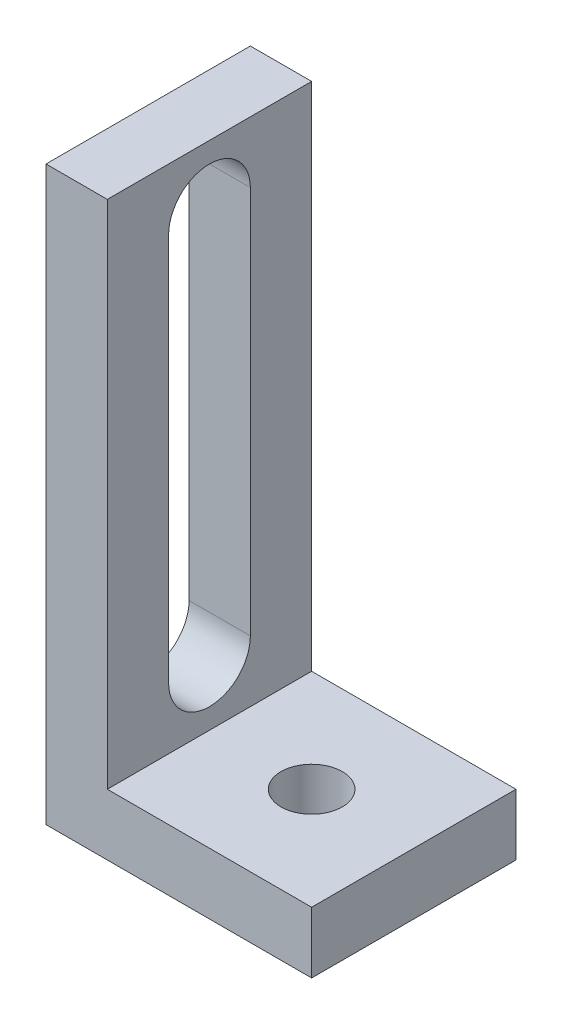
ISO-10303-21;
HEADER;
FILE_DESCRIPTION(('STEP AP214'),'2;1');
FILE_NAME('part.step','',(''),(''),'','','');
FILE_SCHEMA(('AUTOMOTIVE_DESIGN { 1 0 10303 214 1 1 1 1 }'));
ENDSEC;
DATA;
#1=APPLICATION_CONTEXT('core data for automotive mechanical design processes');
#2=APPLICATION_PROTOCOL_DEFINITION('international standard','automotive_design',2000,#1);
#3=PRODUCT_CONTEXT('',#1,'mechanical');
#4=PRODUCT('Part','Part','',(#3));
#5=PRODUCT_RELATED_PRODUCT_CATEGORY('part','',(#4));
#6=PRODUCT_DEFINITION_FORMATION('','',#4);
#7=PRODUCT_DEFINITION_CONTEXT('part definition',#1,'design');
#8=PRODUCT_DEFINITION('design','',#6,#7);
#9=PRODUCT_DEFINITION_SHAPE('','',#8);
#10=(LENGTH_UNIT() NAMED_UNIT(*) SI_UNIT(.MILLI.,.METRE.));
#11=(NAMED_UNIT(*) PLANE_ANGLE_UNIT() SI_UNIT($,.RADIAN.));
#12=(NAMED_UNIT(*) SI_UNIT($,.STERADIAN.) SOLID_ANGLE_UNIT());
#13=UNCERTAINTY_MEASURE_WITH_UNIT(LENGTH_MEASURE(1.E-05),#10,'distance_accuracy_value','');
#14=(GEOMETRIC_REPRESENTATION_CONTEXT(3) GLOBAL_UNCERTAINTY_ASSIGNED_CONTEXT((#13)) GLOBAL_UNIT_ASSIGNED_CONTEXT((#10,
#11,#12)) REPRESENTATION_CONTEXT('',''));
#15=CARTESIAN_POINT('',(0.,0.,0.));
#16=DIRECTION('',(0.,0.,1.));
#17=DIRECTION('',(1.,0.,0.));
#18=AXIS2_PLACEMENT_3D('',#15,#16,#17);
#19=CARTESIAN_POINT('',(10.,3.,10.));
#20=DIRECTION('',(-1.,0.,0.));
#21=DIRECTION('',(0.,0.,1.));
#22=AXIS2_PLACEMENT_3D('',#19,#20,#21);
#23=PLANE('',#22);
#24=DIRECTION('',(0.,0.,-1.));
#25=VECTOR('',#24,1.);
#26=CARTESIAN_POINT('',(10.,0.,10.));
#27=LINE('',#26,#25);
#28=CARTESIAN_POINT('',(10.,0.,10.));
#29=VERTEX_POINT('',#28);
#30=CARTESIAN_POINT('',(10.,0.,0.));
#31=VERTEX_POINT('',#30);
#32=EDGE_CURVE('E166',#29,#31,#27,.T.);
#33=ORIENTED_EDGE('',*,*,#32,.T.);
#34=DIRECTION('',(0.,-1.,0.));
#35=VECTOR('',#34,1.);
#36=CARTESIAN_POINT('',(10.,3.,0.));
#37=LINE('',#36,#35);
#38=CARTESIAN_POINT('',(10.,3.,0.));
#39=VERTEX_POINT('',#38);
#40=EDGE_CURVE('E189',#39,#31,#37,.T.);
#41=ORIENTED_EDGE('',*,*,#40,.F.);
#42=DIRECTION('',(0.,0.,-1.));
#43=VECTOR('',#42,1.);
#44=CARTESIAN_POINT('',(10.,3.,10.));
#45=LINE('',#44,#43);
#46=CARTESIAN_POINT('',(10.,3.,10.));
#47=VERTEX_POINT('',#46);
#48=EDGE_CURVE('E169',#47,#39,#45,.T.);
#49=ORIENTED_EDGE('',*,*,#48,.F.);
#50=DIRECTION('',(0.,-1.,0.));
#51=VECTOR('',#50,1.);
#52=CARTESIAN_POINT('',(10.,3.,10.));
#53=LINE('',#52,#51);
#54=EDGE_CURVE('E181',#47,#29,#53,.T.);
#55=ORIENTED_EDGE('',*,*,#54,.T.);
#56=EDGE_LOOP('',(#33,#41,#49,#55));
#57=FACE_BOUND('',#56,.T.);
#58=ADVANCED_FACE('F35',(#57),#23,.F.);
#59=CARTESIAN_POINT('',(10.,3.,0.));
#60=DIRECTION('',(0.,0.,1.));
#61=DIRECTION('',(1.,0.,0.));
#62=AXIS2_PLACEMENT_3D('',#59,#60,#61);
#63=PLANE('',#62);
#64=DIRECTION('',(-1.,0.,0.));
#65=VECTOR('',#64,1.);
#66=CARTESIAN_POINT('',(10.,0.,0.));
#67=LINE('',#66,#65);
#68=CARTESIAN_POINT('',(-3.,0.,0.));
#69=VERTEX_POINT('',#68);
#70=EDGE_CURVE('E184',#31,#69,#67,.T.);
#71=ORIENTED_EDGE('',*,*,#70,.T.);
#72=DIRECTION('',(0.,-1.,0.));
#73=VECTOR('',#72,1.);
#74=CARTESIAN_POINT('',(-3.,28.,0.));
#75=LINE('',#74,#73);
#76=CARTESIAN_POINT('',(-3.,28.,0.));
#77=VERTEX_POINT('',#76);
#78=EDGE_CURVE('E145',#77,#69,#75,.T.);
#79=ORIENTED_EDGE('',*,*,#78,.F.);
#80=DIRECTION('',(-1.,0.,0.));
#81=VECTOR('',#80,1.);
#82=CARTESIAN_POINT('',(0.,28.,0.));
#83=LINE('',#82,#81);
#84=CARTESIAN_POINT('',(0.,28.,0.));
#85=VERTEX_POINT('',#84);
#86=EDGE_CURVE('E141',#85,#77,#83,.T.);
#87=ORIENTED_EDGE('',*,*,#86,.F.);
#88=DIRECTION('',(0.,1.,0.));
#89=VECTOR('',#88,1.);
#90=CARTESIAN_POINT('',(0.,3.,0.));
#91=LINE('',#90,#89);
#92=CARTESIAN_POINT('',(0.,3.,0.));
#93=VERTEX_POINT('',#92);
#94=EDGE_CURVE('E139',#93,#85,#91,.T.);
#95=ORIENTED_EDGE('',*,*,#94,.F.);
#96=DIRECTION('',(-1.,0.,0.));
#97=VECTOR('',#96,1.);
#98=CARTESIAN_POINT('',(10.,3.,0.));
#99=LINE('',#98,#97);
#100=EDGE_CURVE('E172',#39,#93,#99,.T.);
#101=ORIENTED_EDGE('',*,*,#100,.F.);
#102=ORIENTED_EDGE('',*,*,#40,.T.);
#103=EDGE_LOOP('',(#71,#79,#87,#95,#101,#102));
#104=FACE_BOUND('',#103,.T.);
#105=ADVANCED_FACE('F216',(#104),#63,.F.);
#106=CARTESIAN_POINT('',(0.,3.,10.));
#107=DIRECTION('',(0.,0.,-1.));
#108=DIRECTION('',(-1.,0.,0.));
#109=AXIS2_PLACEMENT_3D('',#106,#107,#108);
#110=PLANE('',#109);
#111=DIRECTION('',(1.,0.,0.));
#112=VECTOR('',#111,1.);
#113=CARTESIAN_POINT('',(0.,0.,10.));
#114=LINE('',#113,#112);
#115=CARTESIAN_POINT('',(-3.,0.,10.));
#116=VERTEX_POINT('',#115);
#117=EDGE_CURVE('E173',#116,#29,#114,.T.);
#118=ORIENTED_EDGE('',*,*,#117,.T.);
#119=ORIENTED_EDGE('',*,*,#54,.F.);
#120=DIRECTION('',(1.,0.,0.));
#121=VECTOR('',#120,1.);
#122=CARTESIAN_POINT('',(0.,3.,10.));
#123=LINE('',#122,#121);
#124=CARTESIAN_POINT('',(0.,3.,10.));
#125=VERTEX_POINT('',#124);
#126=EDGE_CURVE('E179',#125,#47,#123,.T.);
#127=ORIENTED_EDGE('',*,*,#126,.F.);
#128=DIRECTION('',(0.,1.,0.));
#129=VECTOR('',#128,1.);
#130=CARTESIAN_POINT('',(0.,3.,10.));
#131=LINE('',#130,#129);
#132=CARTESIAN_POINT('',(0.,28.,10.));
#133=VERTEX_POINT('',#132);
#134=EDGE_CURVE('E136',#125,#133,#131,.T.);
#135=ORIENTED_EDGE('',*,*,#134,.T.);
#136=DIRECTION('',(-1.,0.,0.));
#137=VECTOR('',#136,1.);
#138=CARTESIAN_POINT('',(0.,28.,10.));
#139=LINE('',#138,#137);
#140=CARTESIAN_POINT('',(-3.,28.,10.));
#141=VERTEX_POINT('',#140);
#142=EDGE_CURVE('E150',#133,#141,#139,.T.);
#143=ORIENTED_EDGE('',*,*,#142,.T.);
#144=DIRECTION('',(0.,-1.,0.));
#145=VECTOR('',#144,1.);
#146=CARTESIAN_POINT('',(-3.,28.,10.));
#147=LINE('',#146,#145);
#148=EDGE_CURVE('E142',#141,#116,#147,.T.);
#149=ORIENTED_EDGE('',*,*,#148,.T.);
#150=EDGE_LOOP('',(#118,#119,#127,#135,#143,#149));
#151=FACE_BOUND('',#150,.T.);
#152=ADVANCED_FACE('F221',(#151),#110,.F.);
#153=CARTESIAN_POINT('',(0.,3.,0.));
#154=DIRECTION('',(0.,1.,0.));
#155=DIRECTION('',(0.,0.,1.));
#156=AXIS2_PLACEMENT_3D('',#153,#154,#155);
#157=PLANE('',#156);
#158=CARTESIAN_POINT('',(5.,3.,5.));
#159=DIRECTION('',(0.,1.,0.));
#160=DIRECTION('',(0.,0.,1.));
#161=AXIS2_PLACEMENT_3D('',#158,#159,#160);
#162=CIRCLE('',#161,1.5);
#163=CARTESIAN_POINT('',(5.,3.,6.5));
#164=VERTEX_POINT('',#163);
#165=EDGE_CURVE('E158',#164,#164,#162,.T.);
#166=ORIENTED_EDGE('',*,*,#165,.F.);
#167=EDGE_LOOP('',(#166));
#168=FACE_BOUND('',#167,.T.);
#169=ORIENTED_EDGE('',*,*,#48,.T.);
#170=ORIENTED_EDGE('',*,*,#100,.T.);
#171=DIRECTION('',(0.,0.,1.));
#172=VECTOR('',#171,1.);
#173=CARTESIAN_POINT('',(0.,3.,0.));
#174=LINE('',#173,#172);
#175=EDGE_CURVE('E176',#93,#125,#174,.T.);
#176=ORIENTED_EDGE('',*,*,#175,.T.);
#177=ORIENTED_EDGE('',*,*,#126,.T.);
#178=EDGE_LOOP('',(#169,#170,#176,#177));
#179=FACE_BOUND('',#178,.T.);
#180=ADVANCED_FACE('F234',(#168,#179),#157,.T.);
#181=CARTESIAN_POINT('',(0.,0.,0.));
#182=DIRECTION('',(0.,1.,0.));
#183=DIRECTION('',(0.,0.,1.));
#184=AXIS2_PLACEMENT_3D('',#181,#182,#183);
#185=PLANE('',#184);
#186=CARTESIAN_POINT('',(5.,0.,5.));
#187=DIRECTION('',(0.,1.,0.));
#188=DIRECTION('',(0.,0.,1.));
#189=AXIS2_PLACEMENT_3D('',#186,#187,#188);
#190=CIRCLE('',#189,1.5);
#191=CARTESIAN_POINT('',(5.,0.,6.5));
#192=VERTEX_POINT('',#191);
#193=EDGE_CURVE('E163',#192,#192,#190,.T.);
#194=ORIENTED_EDGE('',*,*,#193,.T.);
#195=EDGE_LOOP('',(#194));
#196=FACE_BOUND('',#195,.T.);
#197=ORIENTED_EDGE('',*,*,#32,.F.);
#198=ORIENTED_EDGE('',*,*,#117,.F.);
#199=DIRECTION('',(0.,0.,1.));
#200=VECTOR('',#199,1.);
#201=CARTESIAN_POINT('',(-3.,0.,0.));
#202=LINE('',#201,#200);
#203=EDGE_CURVE('E155',#69,#116,#202,.T.);
#204=ORIENTED_EDGE('',*,*,#203,.F.);
#205=ORIENTED_EDGE('',*,*,#70,.F.);
#206=EDGE_LOOP('',(#197,#198,#204,#205));
#207=FACE_BOUND('',#206,.T.);
#208=ADVANCED_FACE('F228',(#196,#207),#185,.F.);
#209=CARTESIAN_POINT('',(5.,0.,5.));
#210=DIRECTION('',(0.,1.,0.));
#211=DIRECTION('',(0.,0.,1.));
#212=AXIS2_PLACEMENT_3D('',#209,#210,#211);
#213=CYLINDRICAL_SURFACE('',#212,1.5);
#214=ORIENTED_EDGE('',*,*,#193,.F.);
#215=EDGE_LOOP('',(#214));
#216=FACE_BOUND('',#215,.T.);
#217=ORIENTED_EDGE('',*,*,#165,.T.);
#218=EDGE_LOOP('',(#217));
#219=FACE_BOUND('',#218,.T.);
#220=ADVANCED_FACE('F241',(#216,#219),#213,.F.);
#221=CARTESIAN_POINT('',(0.,3.,0.));
#222=DIRECTION('',(1.,0.,0.));
#223=DIRECTION('',(0.,1.,0.));
#224=AXIS2_PLACEMENT_3D('',#221,#222,#223);
#225=PLANE('',#224);
#226=CARTESIAN_POINT('',(0.,25.,5.));
#227=DIRECTION('',(1.,0.,0.));
#228=DIRECTION('',(0.,1.,0.));
#229=AXIS2_PLACEMENT_3D('',#226,#227,#228);
#230=CIRCLE('',#229,2.);
#231=CARTESIAN_POINT('',(0.,25.,3.));
#232=VERTEX_POINT('',#231);
#233=CARTESIAN_POINT('',(0.,25.,7.));
#234=VERTEX_POINT('',#233);
#235=EDGE_CURVE('E49',#232,#234,#230,.T.);
#236=ORIENTED_EDGE('',*,*,#235,.F.);
#237=DIRECTION('',(0.,1.,0.));
#238=VECTOR('',#237,1.);
#239=CARTESIAN_POINT('',(0.,25.,3.));
#240=LINE('',#239,#238);
#241=CARTESIAN_POINT('',(0.,6.,3.));
#242=VERTEX_POINT('',#241);
#243=EDGE_CURVE('E129',#242,#232,#240,.T.);
#244=ORIENTED_EDGE('',*,*,#243,.F.);
#245=CARTESIAN_POINT('',(0.,6.,5.));
#246=DIRECTION('',(1.,0.,0.));
#247=DIRECTION('',(0.,1.,0.));
#248=AXIS2_PLACEMENT_3D('',#245,#246,#247);
#249=CIRCLE('',#248,2.);
#250=CARTESIAN_POINT('',(0.,6.,7.));
#251=VERTEX_POINT('',#250);
#252=EDGE_CURVE('E113',#251,#242,#249,.T.);
#253=ORIENTED_EDGE('',*,*,#252,.F.);
#254=DIRECTION('',(0.,-1.,0.));
#255=VECTOR('',#254,1.);
#256=CARTESIAN_POINT('',(0.,25.,7.));
#257=LINE('',#256,#255);
#258=EDGE_CURVE('E122',#234,#251,#257,.T.);
#259=ORIENTED_EDGE('',*,*,#258,.F.);
#260=EDGE_LOOP('',(#236,#244,#253,#259));
#261=FACE_BOUND('',#260,.T.);
#262=ORIENTED_EDGE('',*,*,#175,.F.);
#263=ORIENTED_EDGE('',*,*,#94,.T.);
#264=DIRECTION('',(0.,0.,1.));
#265=VECTOR('',#264,1.);
#266=CARTESIAN_POINT('',(0.,28.,0.));
#267=LINE('',#266,#265);
#268=EDGE_CURVE('E148',#85,#133,#267,.T.);
#269=ORIENTED_EDGE('',*,*,#268,.T.);
#270=ORIENTED_EDGE('',*,*,#134,.F.);
#271=EDGE_LOOP('',(#262,#263,#269,#270));
#272=FACE_BOUND('',#271,.T.);
#273=ADVANCED_FACE('F126',(#261,#272),#225,.T.);
#274=CARTESIAN_POINT('',(-3.,28.,0.));
#275=DIRECTION('',(-1.,0.,0.));
#276=DIRECTION('',(0.,0.,1.));
#277=AXIS2_PLACEMENT_3D('',#274,#275,#276);
#278=PLANE('',#277);
#279=CARTESIAN_POINT('',(-3.,25.,5.));
#280=DIRECTION('',(-1.,0.,0.));
#281=DIRECTION('',(0.,0.,1.));
#282=AXIS2_PLACEMENT_3D('',#279,#280,#281);
#283=CIRCLE('',#282,2.);
#284=CARTESIAN_POINT('',(-3.,25.,7.));
#285=VERTEX_POINT('',#284);
#286=CARTESIAN_POINT('',(-3.,25.,3.));
#287=VERTEX_POINT('',#286);
#288=EDGE_CURVE('E11',#285,#287,#283,.T.);
#289=ORIENTED_EDGE('',*,*,#288,.F.);
#290=DIRECTION('',(0.,1.,0.));
#291=VECTOR('',#290,1.);
#292=CARTESIAN_POINT('',(-3.,28.,7.));
#293=LINE('',#292,#291);
#294=CARTESIAN_POINT('',(-3.,6.,7.));
#295=VERTEX_POINT('',#294);
#296=EDGE_CURVE('E192',#295,#285,#293,.T.);
#297=ORIENTED_EDGE('',*,*,#296,.F.);
#298=CARTESIAN_POINT('',(-3.,6.,5.));
#299=DIRECTION('',(-1.,0.,0.));
#300=DIRECTION('',(0.,0.,1.));
#301=AXIS2_PLACEMENT_3D('',#298,#299,#300);
#302=CIRCLE('',#301,2.);
#303=CARTESIAN_POINT('',(-3.,6.,3.));
#304=VERTEX_POINT('',#303);
#305=EDGE_CURVE('E116',#304,#295,#302,.T.);
#306=ORIENTED_EDGE('',*,*,#305,.F.);
#307=DIRECTION('',(0.,-1.,0.));
#308=VECTOR('',#307,1.);
#309=CARTESIAN_POINT('',(-3.,28.,3.));
#310=LINE('',#309,#308);
#311=EDGE_CURVE('E42',#287,#304,#310,.T.);
#312=ORIENTED_EDGE('',*,*,#311,.F.);
#313=EDGE_LOOP('',(#289,#297,#306,#312));
#314=FACE_BOUND('',#313,.T.);
#315=ORIENTED_EDGE('',*,*,#148,.F.);
#316=DIRECTION('',(0.,0.,1.));
#317=VECTOR('',#316,1.);
#318=CARTESIAN_POINT('',(-3.,28.,0.));
#319=LINE('',#318,#317);
#320=EDGE_CURVE('E159',#77,#141,#319,.T.);
#321=ORIENTED_EDGE('',*,*,#320,.F.);
#322=ORIENTED_EDGE('',*,*,#78,.T.);
#323=ORIENTED_EDGE('',*,*,#203,.T.);
#324=EDGE_LOOP('',(#315,#321,#322,#323));
#325=FACE_BOUND('',#324,.T.);
#326=ADVANCED_FACE('F200',(#314,#325),#278,.T.);
#327=CARTESIAN_POINT('',(0.,28.,0.));
#328=DIRECTION('',(0.,1.,0.));
#329=DIRECTION('',(0.,0.,1.));
#330=AXIS2_PLACEMENT_3D('',#327,#328,#329);
#331=PLANE('',#330);
#332=ORIENTED_EDGE('',*,*,#142,.F.);
#333=ORIENTED_EDGE('',*,*,#268,.F.);
#334=ORIENTED_EDGE('',*,*,#86,.T.);
#335=ORIENTED_EDGE('',*,*,#320,.T.);
#336=EDGE_LOOP('',(#332,#333,#334,#335));
#337=FACE_BOUND('',#336,.T.);
#338=ADVANCED_FACE('F204',(#337),#331,.T.);
#339=CARTESIAN_POINT('',(-10.,25.,5.));
#340=DIRECTION('',(1.,0.,0.));
#341=DIRECTION('',(0.,1.,0.));
#342=AXIS2_PLACEMENT_3D('',#339,#340,#341);
#343=CYLINDRICAL_SURFACE('',#342,2.);
#344=ORIENTED_EDGE('',*,*,#288,.T.);
#345=DIRECTION('',(1.,0.,0.));
#346=VECTOR('',#345,1.);
#347=CARTESIAN_POINT('',(-10.,25.,3.));
#348=LINE('',#347,#346);
#349=EDGE_CURVE('E134',#287,#232,#348,.T.);
#350=ORIENTED_EDGE('',*,*,#349,.T.);
#351=ORIENTED_EDGE('',*,*,#235,.T.);
#352=DIRECTION('',(1.,0.,0.));
#353=VECTOR('',#352,1.);
#354=CARTESIAN_POINT('',(-10.,25.,7.));
#355=LINE('',#354,#353);
#356=EDGE_CURVE('E119',#285,#234,#355,.T.);
#357=ORIENTED_EDGE('',*,*,#356,.F.);
#358=EDGE_LOOP('',(#344,#350,#351,#357));
#359=FACE_BOUND('',#358,.T.);
#360=ADVANCED_FACE('F202',(#359),#343,.F.);
#361=CARTESIAN_POINT('',(-10.,25.,3.));
#362=DIRECTION('',(0.,0.,-1.));
#363=DIRECTION('',(0.,1.,0.));
#364=AXIS2_PLACEMENT_3D('',#361,#362,#363);
#365=PLANE('',#364);
#366=ORIENTED_EDGE('',*,*,#311,.T.);
#367=DIRECTION('',(1.,0.,0.));
#368=VECTOR('',#367,1.);
#369=CARTESIAN_POINT('',(-10.,6.,3.));
#370=LINE('',#369,#368);
#371=EDGE_CURVE('E118',#304,#242,#370,.T.);
#372=ORIENTED_EDGE('',*,*,#371,.T.);
#373=ORIENTED_EDGE('',*,*,#243,.T.);
#374=ORIENTED_EDGE('',*,*,#349,.F.);
#375=EDGE_LOOP('',(#366,#372,#373,#374));
#376=FACE_BOUND('',#375,.T.);
#377=ADVANCED_FACE('F197',(#376),#365,.F.);
#378=CARTESIAN_POINT('',(-10.,6.,5.));
#379=DIRECTION('',(1.,0.,0.));
#380=DIRECTION('',(0.,1.,0.));
#381=AXIS2_PLACEMENT_3D('',#378,#379,#380);
#382=CYLINDRICAL_SURFACE('',#381,2.);
#383=ORIENTED_EDGE('',*,*,#305,.T.);
#384=DIRECTION('',(1.,0.,0.));
#385=VECTOR('',#384,1.);
#386=CARTESIAN_POINT('',(-10.,6.,7.));
#387=LINE('',#386,#385);
#388=EDGE_CURVE('E57',#295,#251,#387,.T.);
#389=ORIENTED_EDGE('',*,*,#388,.T.);
#390=ORIENTED_EDGE('',*,*,#252,.T.);
#391=ORIENTED_EDGE('',*,*,#371,.F.);
#392=EDGE_LOOP('',(#383,#389,#390,#391));
#393=FACE_BOUND('',#392,.T.);
#394=ADVANCED_FACE('F110',(#393),#382,.F.);
#395=CARTESIAN_POINT('',(-10.,25.,7.));
#396=DIRECTION('',(0.,0.,1.));
#397=DIRECTION('',(0.,-1.,0.));
#398=AXIS2_PLACEMENT_3D('',#395,#396,#397);
#399=PLANE('',#398);
#400=ORIENTED_EDGE('',*,*,#296,.T.);
#401=ORIENTED_EDGE('',*,*,#356,.T.);
#402=ORIENTED_EDGE('',*,*,#258,.T.);
#403=ORIENTED_EDGE('',*,*,#388,.F.);
#404=EDGE_LOOP('',(#400,#401,#402,#403));
#405=FACE_BOUND('',#404,.T.);
#406=ADVANCED_FACE('F123',(#405),#399,.F.);
#407=CLOSED_SHELL('',(#58,#105,#152,#180,#208,#220,#273,#326,#338,#360,#377,#394,#406));
#408=MANIFOLD_SOLID_BREP('B2',#407);
#409=ADVANCED_BREP_SHAPE_REPRESENTATION('',(#18,#408),#14);
#410=SHAPE_DEFINITION_REPRESENTATION(#9,#409);
ENDSEC;
END-ISO-10303-21;
